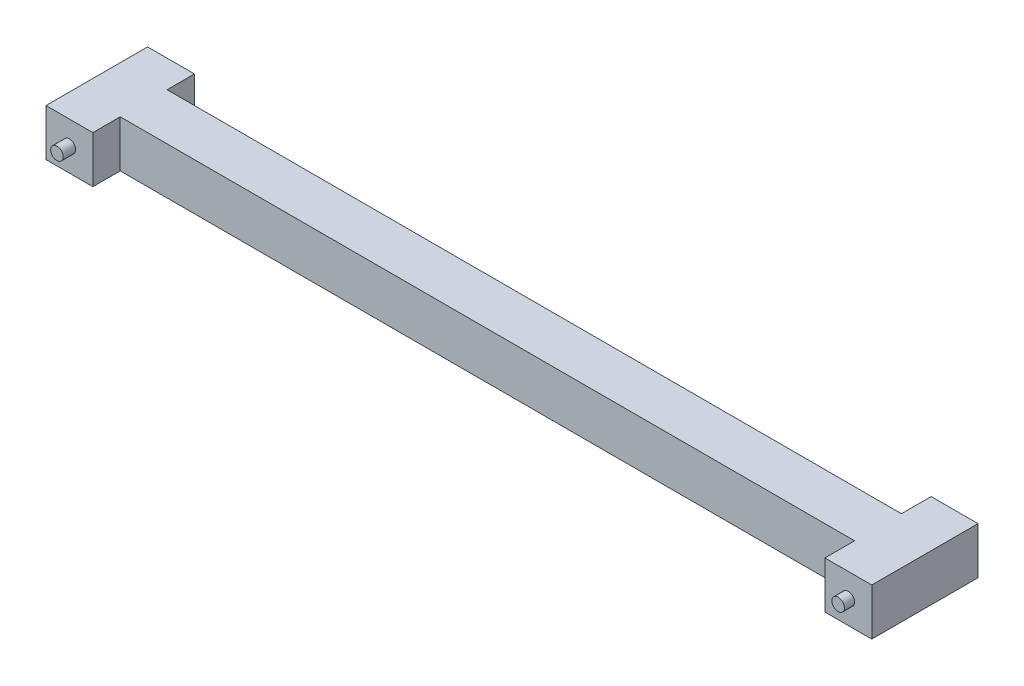
ISO-10303-21;
HEADER;
FILE_DESCRIPTION(('STEP AP214'),'2;1');
FILE_NAME('part.step','',(''),(''),'','','');
FILE_SCHEMA(('AUTOMOTIVE_DESIGN { 1 0 10303 214 1 1 1 1 }'));
ENDSEC;
DATA;
#1=APPLICATION_CONTEXT('core data for automotive mechanical design processes');
#2=APPLICATION_PROTOCOL_DEFINITION('international standard','automotive_design',2000,#1);
#3=PRODUCT_CONTEXT('',#1,'mechanical');
#4=PRODUCT('Part','Part','',(#3));
#5=PRODUCT_RELATED_PRODUCT_CATEGORY('part','',(#4));
#6=PRODUCT_DEFINITION_FORMATION('','',#4);
#7=PRODUCT_DEFINITION_CONTEXT('part definition',#1,'design');
#8=PRODUCT_DEFINITION('design','',#6,#7);
#9=PRODUCT_DEFINITION_SHAPE('','',#8);
#10=(LENGTH_UNIT() NAMED_UNIT(*) SI_UNIT(.MILLI.,.METRE.));
#11=(NAMED_UNIT(*) PLANE_ANGLE_UNIT() SI_UNIT($,.RADIAN.));
#12=(NAMED_UNIT(*) SI_UNIT($,.STERADIAN.) SOLID_ANGLE_UNIT());
#13=UNCERTAINTY_MEASURE_WITH_UNIT(LENGTH_MEASURE(1.E-05),#10,'distance_accuracy_value','');
#14=(GEOMETRIC_REPRESENTATION_CONTEXT(3) GLOBAL_UNCERTAINTY_ASSIGNED_CONTEXT((#13)) GLOBAL_UNIT_ASSIGNED_CONTEXT((#10,
#11,#12)) REPRESENTATION_CONTEXT('',''));
#15=CARTESIAN_POINT('',(0.,0.,0.));
#16=DIRECTION('',(0.,0.,1.));
#17=DIRECTION('',(1.,0.,0.));
#18=AXIS2_PLACEMENT_3D('',#15,#16,#17);
#19=CARTESIAN_POINT('',(1.40910824988077,-0.4272484501669,13.));
#20=DIRECTION('',(-1.,0.,0.));
#21=DIRECTION('',(0.,-1.,0.));
#22=AXIS2_PLACEMENT_3D('',#19,#20,#21);
#23=PLANE('',#22);
#24=DIRECTION('',(0.,-1.,0.));
#25=VECTOR('',#24,1.);
#26=CARTESIAN_POINT('',(1.40910824988077,0.,9.5));
#27=LINE('',#26,#25);
#28=CARTESIAN_POINT('',(1.40910824988077,-0.4272484501669,9.5));
#29=VERTEX_POINT('',#28);
#30=CARTESIAN_POINT('',(1.40910824988077,-6.4272484501669,9.5));
#31=VERTEX_POINT('',#30);
#32=EDGE_CURVE('E164',#29,#31,#27,.T.);
#33=ORIENTED_EDGE('',*,*,#32,.F.);
#34=DIRECTION('',(0.,0.,-1.));
#35=VECTOR('',#34,1.);
#36=CARTESIAN_POINT('',(1.40910824988077,-0.4272484501669,13.));
#37=LINE('',#36,#35);
#38=CARTESIAN_POINT('',(1.40910824988077,-0.4272484501669,13.));
#39=VERTEX_POINT('',#38);
#40=EDGE_CURVE('E235',#39,#29,#37,.T.);
#41=ORIENTED_EDGE('',*,*,#40,.F.);
#42=DIRECTION('',(0.,1.,0.));
#43=VECTOR('',#42,1.);
#44=CARTESIAN_POINT('',(1.40910824988077,-0.4272484501669,13.));
#45=LINE('',#44,#43);
#46=CARTESIAN_POINT('',(1.40910824988077,-6.4272484501669,13.));
#47=VERTEX_POINT('',#46);
#48=EDGE_CURVE('E214',#47,#39,#45,.T.);
#49=ORIENTED_EDGE('',*,*,#48,.F.);
#50=DIRECTION('',(0.,0.,-1.));
#51=VECTOR('',#50,1.);
#52=CARTESIAN_POINT('',(1.40910824988077,-6.4272484501669,13.));
#53=LINE('',#52,#51);
#54=EDGE_CURVE('E240',#47,#31,#53,.T.);
#55=ORIENTED_EDGE('',*,*,#54,.T.);
#56=EDGE_LOOP('',(#33,#41,#49,#55));
#57=FACE_BOUND('',#56,.T.);
#58=ADVANCED_FACE('F41',(#57),#23,.F.);
#59=CARTESIAN_POINT('',(-4.59089175011923,-0.4272484501669,13.));
#60=DIRECTION('',(1.,0.,0.));
#61=DIRECTION('',(0.,0.,-1.));
#62=AXIS2_PLACEMENT_3D('',#59,#60,#61);
#63=PLANE('',#62);
#64=DIRECTION('',(0.,-1.,0.));
#65=VECTOR('',#64,1.);
#66=CARTESIAN_POINT('',(-4.59089175011923,-0.4272484501669,0.));
#67=LINE('',#66,#65);
#68=CARTESIAN_POINT('',(-4.59089175011923,-0.4272484501669,0.));
#69=VERTEX_POINT('',#68);
#70=CARTESIAN_POINT('',(-4.59089175011923,-6.4272484501669,0.));
#71=VERTEX_POINT('',#70);
#72=EDGE_CURVE('E200',#69,#71,#67,.T.);
#73=ORIENTED_EDGE('',*,*,#72,.T.);
#74=DIRECTION('',(0.,0.,-1.));
#75=VECTOR('',#74,1.);
#76=CARTESIAN_POINT('',(-4.59089175011923,-6.4272484501669,13.));
#77=LINE('',#76,#75);
#78=CARTESIAN_POINT('',(-4.59089175011923,-6.4272484501669,13.));
#79=VERTEX_POINT('',#78);
#80=EDGE_CURVE('E205',#79,#71,#77,.T.);
#81=ORIENTED_EDGE('',*,*,#80,.F.);
#82=DIRECTION('',(0.,-1.,0.));
#83=VECTOR('',#82,1.);
#84=CARTESIAN_POINT('',(-4.59089175011923,-0.4272484501669,13.));
#85=LINE('',#84,#83);
#86=CARTESIAN_POINT('',(-4.59089175011923,-0.4272484501669,13.));
#87=VERTEX_POINT('',#86);
#88=EDGE_CURVE('E206',#87,#79,#85,.T.);
#89=ORIENTED_EDGE('',*,*,#88,.F.);
#90=DIRECTION('',(0.,0.,-1.));
#91=VECTOR('',#90,1.);
#92=CARTESIAN_POINT('',(-4.59089175011923,-0.4272484501669,13.));
#93=LINE('',#92,#91);
#94=EDGE_CURVE('E220',#87,#69,#93,.T.);
#95=ORIENTED_EDGE('',*,*,#94,.T.);
#96=EDGE_LOOP('',(#73,#81,#89,#95));
#97=FACE_BOUND('',#96,.T.);
#98=ADVANCED_FACE('F43',(#97),#63,.F.);
#99=CARTESIAN_POINT('',(-4.59089175011923,-6.4272484501669,13.));
#100=DIRECTION('',(0.,1.,0.));
#101=DIRECTION('',(0.,0.,1.));
#102=AXIS2_PLACEMENT_3D('',#99,#100,#101);
#103=PLANE('',#102);
#104=DIRECTION('',(1.,0.,0.));
#105=VECTOR('',#104,1.);
#106=CARTESIAN_POINT('',(-4.59089175011923,-6.4272484501669,0.));
#107=LINE('',#106,#105);
#108=CARTESIAN_POINT('',(1.40910824988077,-6.4272484501669,0.));
#109=VERTEX_POINT('',#108);
#110=EDGE_CURVE('E224',#71,#109,#107,.T.);
#111=ORIENTED_EDGE('',*,*,#110,.T.);
#112=CARTESIAN_POINT('',(1.40910824988077,-6.4272484501669,3.5));
#113=VERTEX_POINT('',#112);
#114=EDGE_CURVE('E239',#113,#109,#53,.T.);
#115=ORIENTED_EDGE('',*,*,#114,.F.);
#116=DIRECTION('',(-1.,0.,0.));
#117=VECTOR('',#116,1.);
#118=CARTESIAN_POINT('',(95.4091082498808,-6.42724845016689,3.5));
#119=LINE('',#118,#117);
#120=CARTESIAN_POINT('',(95.4091082498808,-6.42724845016689,3.5));
#121=VERTEX_POINT('',#120);
#122=EDGE_CURVE('E177',#121,#113,#119,.T.);
#123=ORIENTED_EDGE('',*,*,#122,.F.);
#124=DIRECTION('',(0.,0.,-1.));
#125=VECTOR('',#124,1.);
#126=CARTESIAN_POINT('',(95.4091082498808,-6.42724845016689,13.3));
#127=LINE('',#126,#125);
#128=CARTESIAN_POINT('',(95.4091082498808,-6.42724845016689,-0.3));
#129=VERTEX_POINT('',#128);
#130=EDGE_CURVE('E266',#121,#129,#127,.T.);
#131=ORIENTED_EDGE('',*,*,#130,.T.);
#132=DIRECTION('',(-1.,0.,0.));
#133=VECTOR('',#132,1.);
#134=CARTESIAN_POINT('',(101.409108249881,-6.42724845016688,-0.3));
#135=LINE('',#134,#133);
#136=CARTESIAN_POINT('',(101.409108249881,-6.42724845016688,-0.3));
#137=VERTEX_POINT('',#136);
#138=EDGE_CURVE('E140',#137,#129,#135,.T.);
#139=ORIENTED_EDGE('',*,*,#138,.F.);
#140=DIRECTION('',(0.,0.,-1.));
#141=VECTOR('',#140,1.);
#142=CARTESIAN_POINT('',(101.409108249881,-6.42724845016688,13.3));
#143=LINE('',#142,#141);
#144=CARTESIAN_POINT('',(101.409108249881,-6.42724845016688,13.3));
#145=VERTEX_POINT('',#144);
#146=EDGE_CURVE('E131',#145,#137,#143,.T.);
#147=ORIENTED_EDGE('',*,*,#146,.F.);
#148=DIRECTION('',(-1.,0.,0.));
#149=VECTOR('',#148,1.);
#150=CARTESIAN_POINT('',(101.409108249881,-6.42724845016688,13.3));
#151=LINE('',#150,#149);
#152=CARTESIAN_POINT('',(95.4091082498808,-6.42724845016689,13.3));
#153=VERTEX_POINT('',#152);
#154=EDGE_CURVE('E137',#145,#153,#151,.T.);
#155=ORIENTED_EDGE('',*,*,#154,.T.);
#156=CARTESIAN_POINT('',(95.4091082498808,-6.42724845016689,9.5));
#157=VERTEX_POINT('',#156);
#158=EDGE_CURVE('E270',#153,#157,#127,.T.);
#159=ORIENTED_EDGE('',*,*,#158,.T.);
#160=DIRECTION('',(-1.,0.,0.));
#161=VECTOR('',#160,1.);
#162=CARTESIAN_POINT('',(95.4091082498808,-6.42724845016689,9.5));
#163=LINE('',#162,#161);
#164=EDGE_CURVE('E185',#157,#31,#163,.T.);
#165=ORIENTED_EDGE('',*,*,#164,.T.);
#166=ORIENTED_EDGE('',*,*,#54,.F.);
#167=DIRECTION('',(1.,0.,0.));
#168=VECTOR('',#167,1.);
#169=CARTESIAN_POINT('',(-4.59089175011923,-6.4272484501669,13.));
#170=LINE('',#169,#168);
#171=EDGE_CURVE('E210',#79,#47,#170,.T.);
#172=ORIENTED_EDGE('',*,*,#171,.F.);
#173=ORIENTED_EDGE('',*,*,#80,.T.);
#174=EDGE_LOOP('',(#111,#115,#123,#131,#139,#147,#155,#159,#165,#166,#172,#173));
#175=FACE_BOUND('',#174,.T.);
#176=ADVANCED_FACE('F134',(#175),#103,.F.);
#177=CARTESIAN_POINT('',(1.40910824988077,-0.4272484501669,3.5));
#178=VERTEX_POINT('',#177);
#179=CARTESIAN_POINT('',(1.40910824988077,-0.4272484501669,0.));
#180=VERTEX_POINT('',#179);
#181=EDGE_CURVE('E63',#178,#180,#37,.T.);
#182=ORIENTED_EDGE('',*,*,#181,.F.);
#183=DIRECTION('',(0.,-1.,0.));
#184=VECTOR('',#183,1.);
#185=CARTESIAN_POINT('',(1.40910824988077,0.,3.5));
#186=LINE('',#185,#184);
#187=EDGE_CURVE('E58',#178,#113,#186,.T.);
#188=ORIENTED_EDGE('',*,*,#187,.T.);
#189=ORIENTED_EDGE('',*,*,#114,.T.);
#190=DIRECTION('',(0.,1.,0.));
#191=VECTOR('',#190,1.);
#192=CARTESIAN_POINT('',(1.40910824988077,-0.4272484501669,0.));
#193=LINE('',#192,#191);
#194=EDGE_CURVE('E227',#109,#180,#193,.T.);
#195=ORIENTED_EDGE('',*,*,#194,.T.);
#196=EDGE_LOOP('',(#182,#188,#189,#195));
#197=FACE_BOUND('',#196,.T.);
#198=ADVANCED_FACE('F254',(#197),#23,.F.);
#199=CARTESIAN_POINT('',(-4.59089175011923,-0.4272484501669,13.));
#200=DIRECTION('',(0.,-1.,0.));
#201=DIRECTION('',(0.,0.,-1.));
#202=AXIS2_PLACEMENT_3D('',#199,#200,#201);
#203=PLANE('',#202);
#204=DIRECTION('',(-1.,0.,0.));
#205=VECTOR('',#204,1.);
#206=CARTESIAN_POINT('',(-4.59089175011923,-0.4272484501669,0.));
#207=LINE('',#206,#205);
#208=EDGE_CURVE('E211',#180,#69,#207,.T.);
#209=ORIENTED_EDGE('',*,*,#208,.T.);
#210=ORIENTED_EDGE('',*,*,#94,.F.);
#211=DIRECTION('',(-1.,0.,0.));
#212=VECTOR('',#211,1.);
#213=CARTESIAN_POINT('',(-4.59089175011923,-0.4272484501669,13.));
#214=LINE('',#213,#212);
#215=EDGE_CURVE('E217',#39,#87,#214,.T.);
#216=ORIENTED_EDGE('',*,*,#215,.F.);
#217=ORIENTED_EDGE('',*,*,#40,.T.);
#218=DIRECTION('',(-1.,0.,0.));
#219=VECTOR('',#218,1.);
#220=CARTESIAN_POINT('',(95.4091082498808,-0.427248450166887,9.5));
#221=LINE('',#220,#219);
#222=CARTESIAN_POINT('',(95.4091082498808,-0.427248450166887,9.5));
#223=VERTEX_POINT('',#222);
#224=EDGE_CURVE('E189',#223,#29,#221,.T.);
#225=ORIENTED_EDGE('',*,*,#224,.F.);
#226=DIRECTION('',(0.,0.,1.));
#227=VECTOR('',#226,1.);
#228=CARTESIAN_POINT('',(95.4091082498808,-0.427248450166887,13.3));
#229=LINE('',#228,#227);
#230=CARTESIAN_POINT('',(95.4091082498808,-0.427248450166887,13.3));
#231=VERTEX_POINT('',#230);
#232=EDGE_CURVE('E278',#223,#231,#229,.T.);
#233=ORIENTED_EDGE('',*,*,#232,.T.);
#234=DIRECTION('',(-1.,0.,0.));
#235=VECTOR('',#234,1.);
#236=CARTESIAN_POINT('',(101.409108249881,-0.427248450166886,13.3));
#237=LINE('',#236,#235);
#238=CARTESIAN_POINT('',(101.409108249881,-0.427248450166886,13.3));
#239=VERTEX_POINT('',#238);
#240=EDGE_CURVE('E286',#239,#231,#237,.T.);
#241=ORIENTED_EDGE('',*,*,#240,.F.);
#242=DIRECTION('',(0.,0.,1.));
#243=VECTOR('',#242,1.);
#244=CARTESIAN_POINT('',(101.409108249881,-0.427248450166886,13.3));
#245=LINE('',#244,#243);
#246=CARTESIAN_POINT('',(101.409108249881,-0.427248450166886,-0.3));
#247=VERTEX_POINT('',#246);
#248=EDGE_CURVE('E150',#247,#239,#245,.T.);
#249=ORIENTED_EDGE('',*,*,#248,.F.);
#250=DIRECTION('',(-1.,0.,0.));
#251=VECTOR('',#250,1.);
#252=CARTESIAN_POINT('',(101.409108249881,-0.427248450166886,-0.3));
#253=LINE('',#252,#251);
#254=CARTESIAN_POINT('',(95.4091082498808,-0.427248450166887,-0.3));
#255=VERTEX_POINT('',#254);
#256=EDGE_CURVE('E166',#247,#255,#253,.T.);
#257=ORIENTED_EDGE('',*,*,#256,.T.);
#258=CARTESIAN_POINT('',(95.4091082498808,-0.427248450166887,3.5));
#259=VERTEX_POINT('',#258);
#260=EDGE_CURVE('E155',#255,#259,#229,.T.);
#261=ORIENTED_EDGE('',*,*,#260,.T.);
#262=DIRECTION('',(-1.,0.,0.));
#263=VECTOR('',#262,1.);
#264=CARTESIAN_POINT('',(95.4091082498808,-0.427248450166887,3.5));
#265=LINE('',#264,#263);
#266=EDGE_CURVE('E193',#259,#178,#265,.T.);
#267=ORIENTED_EDGE('',*,*,#266,.T.);
#268=ORIENTED_EDGE('',*,*,#181,.T.);
#269=EDGE_LOOP('',(#209,#210,#216,#217,#225,#233,#241,#249,#257,#261,#267,#268));
#270=FACE_BOUND('',#269,.T.);
#271=ADVANCED_FACE('F258',(#270),#203,.F.);
#272=CARTESIAN_POINT('',(0.,0.,13.));
#273=DIRECTION('',(0.,0.,1.));
#274=DIRECTION('',(1.,0.,0.));
#275=AXIS2_PLACEMENT_3D('',#272,#273,#274);
#276=PLANE('',#275);
#277=CARTESIAN_POINT('',(-1.59089175011923,-3.4272484501669,13.));
#278=DIRECTION('',(0.,0.,1.));
#279=DIRECTION('',(1.,0.,0.));
#280=AXIS2_PLACEMENT_3D('',#277,#278,#279);
#281=CIRCLE('',#280,0.8);
#282=CARTESIAN_POINT('',(-0.790891750119231,-3.4272484501669,13.));
#283=VERTEX_POINT('',#282);
#284=EDGE_CURVE('E297',#283,#283,#281,.T.);
#285=ORIENTED_EDGE('',*,*,#284,.F.);
#286=EDGE_LOOP('',(#285));
#287=FACE_BOUND('',#286,.T.);
#288=ORIENTED_EDGE('',*,*,#88,.T.);
#289=ORIENTED_EDGE('',*,*,#171,.T.);
#290=ORIENTED_EDGE('',*,*,#48,.T.);
#291=ORIENTED_EDGE('',*,*,#215,.T.);
#292=EDGE_LOOP('',(#288,#289,#290,#291));
#293=FACE_BOUND('',#292,.T.);
#294=ADVANCED_FACE('F346',(#287,#293),#276,.T.);
#295=CARTESIAN_POINT('',(0.,0.,0.));
#296=DIRECTION('',(0.,0.,1.));
#297=DIRECTION('',(1.,0.,0.));
#298=AXIS2_PLACEMENT_3D('',#295,#296,#297);
#299=PLANE('',#298);
#300=CARTESIAN_POINT('',(-1.59089175011923,-3.4272484501669,0.));
#301=DIRECTION('',(0.,0.,-1.));
#302=DIRECTION('',(-1.,0.,0.));
#303=AXIS2_PLACEMENT_3D('',#300,#301,#302);
#304=CIRCLE('',#303,0.8);
#305=CARTESIAN_POINT('',(-2.39089175011923,-3.4272484501669,0.));
#306=VERTEX_POINT('',#305);
#307=EDGE_CURVE('E201',#306,#306,#304,.T.);
#308=ORIENTED_EDGE('',*,*,#307,.F.);
#309=EDGE_LOOP('',(#308));
#310=FACE_BOUND('',#309,.T.);
#311=ORIENTED_EDGE('',*,*,#72,.F.);
#312=ORIENTED_EDGE('',*,*,#208,.F.);
#313=ORIENTED_EDGE('',*,*,#194,.F.);
#314=ORIENTED_EDGE('',*,*,#110,.F.);
#315=EDGE_LOOP('',(#311,#312,#313,#314));
#316=FACE_BOUND('',#315,.T.);
#317=ADVANCED_FACE('F253',(#310,#316),#299,.F.);
#318=CARTESIAN_POINT('',(-1.59089175011923,-3.4272484501669,-1.6));
#319=DIRECTION('',(0.,0.,1.));
#320=DIRECTION('',(1.,0.,0.));
#321=AXIS2_PLACEMENT_3D('',#318,#319,#320);
#322=CYLINDRICAL_SURFACE('',#321,0.8);
#323=CARTESIAN_POINT('',(-1.59089175011923,-3.4272484501669,-1.6));
#324=DIRECTION('',(0.,0.,-1.));
#325=DIRECTION('',(-1.,0.,0.));
#326=AXIS2_PLACEMENT_3D('',#323,#324,#325);
#327=CIRCLE('',#326,0.8);
#328=CARTESIAN_POINT('',(-2.39089175011923,-3.4272484501669,-1.6));
#329=VERTEX_POINT('',#328);
#330=EDGE_CURVE('E196',#329,#329,#327,.T.);
#331=ORIENTED_EDGE('',*,*,#330,.F.);
#332=EDGE_LOOP('',(#331));
#333=FACE_BOUND('',#332,.T.);
#334=ORIENTED_EDGE('',*,*,#307,.T.);
#335=EDGE_LOOP('',(#334));
#336=FACE_BOUND('',#335,.T.);
#337=ADVANCED_FACE('F364',(#333,#336),#322,.T.);
#338=CARTESIAN_POINT('',(-1.59089175011923,-3.4272484501669,-1.6));
#339=DIRECTION('',(0.,0.,-1.));
#340=DIRECTION('',(-1.,0.,0.));
#341=AXIS2_PLACEMENT_3D('',#338,#339,#340);
#342=PLANE('',#341);
#343=ORIENTED_EDGE('',*,*,#330,.T.);
#344=EDGE_LOOP('',(#343));
#345=FACE_BOUND('',#344,.T.);
#346=ADVANCED_FACE('F376',(#345),#342,.T.);
#347=CARTESIAN_POINT('',(95.4091082498808,0.,3.5));
#348=DIRECTION('',(0.,0.,-1.));
#349=DIRECTION('',(-1.,0.,0.));
#350=AXIS2_PLACEMENT_3D('',#347,#348,#349);
#351=PLANE('',#350);
#352=ORIENTED_EDGE('',*,*,#187,.F.);
#353=ORIENTED_EDGE('',*,*,#266,.F.);
#354=DIRECTION('',(0.,-1.,0.));
#355=VECTOR('',#354,1.);
#356=CARTESIAN_POINT('',(95.4091082498808,0.,3.5));
#357=LINE('',#356,#355);
#358=EDGE_CURVE('E170',#259,#121,#357,.T.);
#359=ORIENTED_EDGE('',*,*,#358,.T.);
#360=ORIENTED_EDGE('',*,*,#122,.T.);
#361=EDGE_LOOP('',(#352,#353,#359,#360));
#362=FACE_BOUND('',#361,.T.);
#363=ADVANCED_FACE('F264',(#362),#351,.T.);
#364=CARTESIAN_POINT('',(95.4091082498808,0.,9.5));
#365=DIRECTION('',(0.,0.,-1.));
#366=DIRECTION('',(-1.,0.,0.));
#367=AXIS2_PLACEMENT_3D('',#364,#365,#366);
#368=PLANE('',#367);
#369=ORIENTED_EDGE('',*,*,#32,.T.);
#370=ORIENTED_EDGE('',*,*,#164,.F.);
#371=DIRECTION('',(0.,-1.,0.));
#372=VECTOR('',#371,1.);
#373=CARTESIAN_POINT('',(95.4091082498808,0.,9.5));
#374=LINE('',#373,#372);
#375=EDGE_CURVE('E174',#223,#157,#374,.T.);
#376=ORIENTED_EDGE('',*,*,#375,.F.);
#377=ORIENTED_EDGE('',*,*,#224,.T.);
#378=EDGE_LOOP('',(#369,#370,#376,#377));
#379=FACE_BOUND('',#378,.T.);
#380=ADVANCED_FACE('F488',(#379),#368,.F.);
#381=CARTESIAN_POINT('',(95.4091082498808,0.,0.));
#382=DIRECTION('',(1.,0.,0.));
#383=DIRECTION('',(0.,0.,-1.));
#384=AXIS2_PLACEMENT_3D('',#381,#382,#383);
#385=PLANE('',#384);
#386=ORIENTED_EDGE('',*,*,#232,.F.);
#387=ORIENTED_EDGE('',*,*,#375,.T.);
#388=ORIENTED_EDGE('',*,*,#158,.F.);
#389=DIRECTION('',(0.,-1.,0.));
#390=VECTOR('',#389,1.);
#391=CARTESIAN_POINT('',(95.4091082498808,-0.427248450166887,13.3));
#392=LINE('',#391,#390);
#393=EDGE_CURVE('E159',#231,#153,#392,.T.);
#394=ORIENTED_EDGE('',*,*,#393,.F.);
#395=EDGE_LOOP('',(#386,#387,#388,#394));
#396=FACE_BOUND('',#395,.T.);
#397=ADVANCED_FACE('F330',(#396),#385,.F.);
#398=CARTESIAN_POINT('',(101.409108249881,-0.427248450166886,13.3));
#399=DIRECTION('',(0.,0.,-1.));
#400=DIRECTION('',(-1.,0.,0.));
#401=AXIS2_PLACEMENT_3D('',#398,#399,#400);
#402=PLANE('',#401);
#403=CARTESIAN_POINT('',(98.4091082498808,-3.4272484501669,13.3));
#404=DIRECTION('',(0.,0.,-1.));
#405=DIRECTION('',(-1.,0.,0.));
#406=AXIS2_PLACEMENT_3D('',#403,#404,#405);
#407=CIRCLE('',#406,0.799999999999995);
#408=CARTESIAN_POINT('',(97.6091082498808,-3.4272484501669,13.3));
#409=VERTEX_POINT('',#408);
#410=EDGE_CURVE('E45',#409,#409,#407,.F.);
#411=ORIENTED_EDGE('',*,*,#410,.F.);
#412=EDGE_LOOP('',(#411));
#413=FACE_BOUND('',#412,.T.);
#414=ORIENTED_EDGE('',*,*,#393,.T.);
#415=ORIENTED_EDGE('',*,*,#154,.F.);
#416=DIRECTION('',(0.,-1.,0.));
#417=VECTOR('',#416,1.);
#418=CARTESIAN_POINT('',(101.409108249881,-0.427248450166886,13.3));
#419=LINE('',#418,#417);
#420=EDGE_CURVE('E145',#239,#145,#419,.T.);
#421=ORIENTED_EDGE('',*,*,#420,.F.);
#422=ORIENTED_EDGE('',*,*,#240,.T.);
#423=EDGE_LOOP('',(#414,#415,#421,#422));
#424=FACE_BOUND('',#423,.T.);
#425=ADVANCED_FACE('F157',(#413,#424),#402,.F.);
#426=CARTESIAN_POINT('',(101.409108249881,-0.427248450166886,-0.3));
#427=DIRECTION('',(0.,0.,1.));
#428=DIRECTION('',(1.,0.,0.));
#429=AXIS2_PLACEMENT_3D('',#426,#427,#428);
#430=PLANE('',#429);
#431=CARTESIAN_POINT('',(98.4091082498808,-3.42724845016689,-0.3));
#432=DIRECTION('',(0.,0.,-1.));
#433=DIRECTION('',(-1.,0.,0.));
#434=AXIS2_PLACEMENT_3D('',#431,#432,#433);
#435=CIRCLE('',#434,0.799999999999995);
#436=CARTESIAN_POINT('',(97.6091082498808,-3.42724845016689,-0.3));
#437=VERTEX_POINT('',#436);
#438=EDGE_CURVE('E11',#437,#437,#435,.T.);
#439=ORIENTED_EDGE('',*,*,#438,.F.);
#440=EDGE_LOOP('',(#439));
#441=FACE_BOUND('',#440,.T.);
#442=DIRECTION('',(0.,1.,0.));
#443=VECTOR('',#442,1.);
#444=CARTESIAN_POINT('',(95.4091082498808,-0.427248450166887,-0.3));
#445=LINE('',#444,#443);
#446=EDGE_CURVE('E275',#129,#255,#445,.T.);
#447=ORIENTED_EDGE('',*,*,#446,.T.);
#448=ORIENTED_EDGE('',*,*,#256,.F.);
#449=DIRECTION('',(0.,1.,0.));
#450=VECTOR('',#449,1.);
#451=CARTESIAN_POINT('',(101.409108249881,-0.427248450166886,-0.3));
#452=LINE('',#451,#450);
#453=EDGE_CURVE('E144',#137,#247,#452,.T.);
#454=ORIENTED_EDGE('',*,*,#453,.F.);
#455=ORIENTED_EDGE('',*,*,#138,.T.);
#456=EDGE_LOOP('',(#447,#448,#454,#455));
#457=FACE_BOUND('',#456,.T.);
#458=ADVANCED_FACE('F273',(#441,#457),#430,.F.);
#459=CARTESIAN_POINT('',(101.409108249881,0.,0.));
#460=DIRECTION('',(1.,0.,0.));
#461=DIRECTION('',(0.,0.,-1.));
#462=AXIS2_PLACEMENT_3D('',#459,#460,#461);
#463=PLANE('',#462);
#464=ORIENTED_EDGE('',*,*,#420,.T.);
#465=ORIENTED_EDGE('',*,*,#146,.T.);
#466=ORIENTED_EDGE('',*,*,#453,.T.);
#467=ORIENTED_EDGE('',*,*,#248,.T.);
#468=EDGE_LOOP('',(#464,#465,#466,#467));
#469=FACE_BOUND('',#468,.T.);
#470=ADVANCED_FACE('F148',(#469),#463,.T.);
#471=ORIENTED_EDGE('',*,*,#358,.F.);
#472=ORIENTED_EDGE('',*,*,#260,.F.);
#473=ORIENTED_EDGE('',*,*,#446,.F.);
#474=ORIENTED_EDGE('',*,*,#130,.F.);
#475=EDGE_LOOP('',(#471,#472,#473,#474));
#476=FACE_BOUND('',#475,.T.);
#477=ADVANCED_FACE('F276',(#476),#385,.F.);
#478=CARTESIAN_POINT('',(-1.59089175011923,-3.4272484501669,14.6));
#479=DIRECTION('',(0.,0.,-1.));
#480=DIRECTION('',(-1.,0.,0.));
#481=AXIS2_PLACEMENT_3D('',#478,#479,#480);
#482=CYLINDRICAL_SURFACE('',#481,0.8);
#483=CARTESIAN_POINT('',(-1.59089175011923,-3.4272484501669,14.6));
#484=DIRECTION('',(0.,0.,1.));
#485=DIRECTION('',(1.,0.,0.));
#486=AXIS2_PLACEMENT_3D('',#483,#484,#485);
#487=CIRCLE('',#486,0.8);
#488=CARTESIAN_POINT('',(-0.790891750119231,-3.4272484501669,14.6));
#489=VERTEX_POINT('',#488);
#490=EDGE_CURVE('E294',#489,#489,#487,.T.);
#491=ORIENTED_EDGE('',*,*,#490,.F.);
#492=EDGE_LOOP('',(#491));
#493=FACE_BOUND('',#492,.T.);
#494=ORIENTED_EDGE('',*,*,#284,.T.);
#495=EDGE_LOOP('',(#494));
#496=FACE_BOUND('',#495,.T.);
#497=ADVANCED_FACE('F432',(#493,#496),#482,.T.);
#498=CARTESIAN_POINT('',(-1.59089175011923,-3.4272484501669,14.6));
#499=DIRECTION('',(0.,0.,1.));
#500=DIRECTION('',(1.,0.,0.));
#501=AXIS2_PLACEMENT_3D('',#498,#499,#500);
#502=PLANE('',#501);
#503=ORIENTED_EDGE('',*,*,#490,.T.);
#504=EDGE_LOOP('',(#503));
#505=FACE_BOUND('',#504,.T.);
#506=ADVANCED_FACE('F437',(#505),#502,.T.);
#507=CARTESIAN_POINT('',(98.4091082498808,-3.4272484501669,14.6));
#508=DIRECTION('',(0.,0.,-1.));
#509=DIRECTION('',(-1.,0.,0.));
#510=AXIS2_PLACEMENT_3D('',#507,#508,#509);
#511=CYLINDRICAL_SURFACE('',#510,0.799999999999995);
#512=CARTESIAN_POINT('',(98.4091082498808,-3.4272484501669,14.6));
#513=DIRECTION('',(0.,0.,1.));
#514=DIRECTION('',(1.,0.,0.));
#515=AXIS2_PLACEMENT_3D('',#512,#513,#514);
#516=CIRCLE('',#515,0.799999999999995);
#517=CARTESIAN_POINT('',(99.2091082498808,-3.4272484501669,14.6));
#518=VERTEX_POINT('',#517);
#519=EDGE_CURVE('E303',#518,#518,#516,.T.);
#520=ORIENTED_EDGE('',*,*,#519,.F.);
#521=EDGE_LOOP('',(#520));
#522=FACE_BOUND('',#521,.T.);
#523=ORIENTED_EDGE('',*,*,#410,.T.);
#524=EDGE_LOOP('',(#523));
#525=FACE_BOUND('',#524,.T.);
#526=ADVANCED_FACE('F447',(#522,#525),#511,.T.);
#527=CARTESIAN_POINT('',(98.4091082498808,-3.4272484501669,14.6));
#528=DIRECTION('',(0.,0.,1.));
#529=DIRECTION('',(1.,0.,0.));
#530=AXIS2_PLACEMENT_3D('',#527,#528,#529);
#531=PLANE('',#530);
#532=ORIENTED_EDGE('',*,*,#519,.T.);
#533=EDGE_LOOP('',(#532));
#534=FACE_BOUND('',#533,.T.);
#535=ADVANCED_FACE('F319',(#534),#531,.T.);
#536=CARTESIAN_POINT('',(98.4091082498808,-3.42724845016689,-1.9));
#537=DIRECTION('',(0.,0.,1.));
#538=DIRECTION('',(1.,0.,0.));
#539=AXIS2_PLACEMENT_3D('',#536,#537,#538);
#540=CYLINDRICAL_SURFACE('',#539,0.799999999999995);
#541=CARTESIAN_POINT('',(98.4091082498808,-3.42724845016689,-1.9));
#542=DIRECTION('',(0.,0.,-1.));
#543=DIRECTION('',(-1.,0.,0.));
#544=AXIS2_PLACEMENT_3D('',#541,#542,#543);
#545=CIRCLE('',#544,0.799999999999995);
#546=CARTESIAN_POINT('',(97.6091082498808,-3.42724845016689,-1.9));
#547=VERTEX_POINT('',#546);
#548=EDGE_CURVE('E308',#547,#547,#545,.T.);
#549=ORIENTED_EDGE('',*,*,#548,.F.);
#550=EDGE_LOOP('',(#549));
#551=FACE_BOUND('',#550,.T.);
#552=ORIENTED_EDGE('',*,*,#438,.T.);
#553=EDGE_LOOP('',(#552));
#554=FACE_BOUND('',#553,.T.);
#555=ADVANCED_FACE('F316',(#551,#554),#540,.T.);
#556=CARTESIAN_POINT('',(98.4091082498808,-3.42724845016689,-1.9));
#557=DIRECTION('',(0.,0.,-1.));
#558=DIRECTION('',(-1.,0.,0.));
#559=AXIS2_PLACEMENT_3D('',#556,#557,#558);
#560=PLANE('',#559);
#561=ORIENTED_EDGE('',*,*,#548,.T.);
#562=EDGE_LOOP('',(#561));
#563=FACE_BOUND('',#562,.T.);
#564=ADVANCED_FACE('F314',(#563),#560,.T.);
#565=CLOSED_SHELL('',(#58,#98,#176,#198,#271,#294,#317,#337,#346,#363,#380,#397,#425,#458,#470,
#477,#497,#506,#526,#535,#555,#564));
#566=MANIFOLD_SOLID_BREP('B2',#565);
#567=ADVANCED_BREP_SHAPE_REPRESENTATION('',(#18,#566),#14);
#568=SHAPE_DEFINITION_REPRESENTATION(#9,#567);
ENDSEC;
END-ISO-10303-21;
